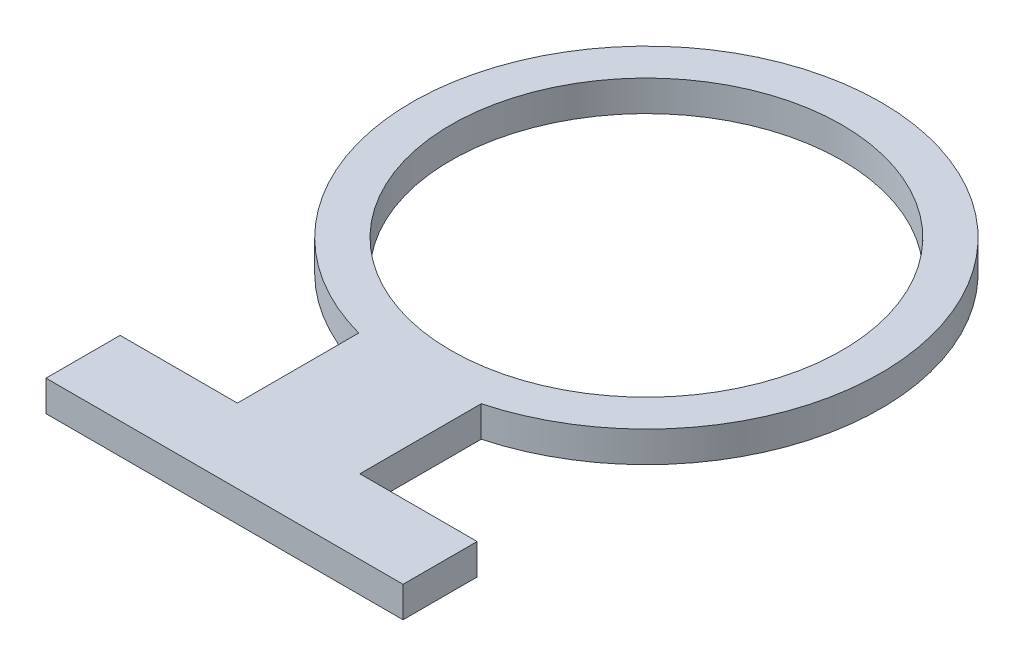
ISO-10303-21;
HEADER;
FILE_DESCRIPTION(('STEP AP214'),'2;1');
FILE_NAME('part.step','',(''),(''),'','','');
FILE_SCHEMA(('AUTOMOTIVE_DESIGN { 1 0 10303 214 1 1 1 1 }'));
ENDSEC;
DATA;
#1=APPLICATION_CONTEXT('core data for automotive mechanical design processes');
#2=APPLICATION_PROTOCOL_DEFINITION('international standard','automotive_design',2000,#1);
#3=PRODUCT_CONTEXT('',#1,'mechanical');
#4=PRODUCT('Part','Part','',(#3));
#5=PRODUCT_RELATED_PRODUCT_CATEGORY('part','',(#4));
#6=PRODUCT_DEFINITION_FORMATION('','',#4);
#7=PRODUCT_DEFINITION_CONTEXT('part definition',#1,'design');
#8=PRODUCT_DEFINITION('design','',#6,#7);
#9=PRODUCT_DEFINITION_SHAPE('','',#8);
#10=(LENGTH_UNIT() NAMED_UNIT(*) SI_UNIT(.MILLI.,.METRE.));
#11=(NAMED_UNIT(*) PLANE_ANGLE_UNIT() SI_UNIT($,.RADIAN.));
#12=(NAMED_UNIT(*) SI_UNIT($,.STERADIAN.) SOLID_ANGLE_UNIT());
#13=UNCERTAINTY_MEASURE_WITH_UNIT(LENGTH_MEASURE(1.E-05),#10,'distance_accuracy_value','');
#14=(GEOMETRIC_REPRESENTATION_CONTEXT(3) GLOBAL_UNCERTAINTY_ASSIGNED_CONTEXT((#13)) GLOBAL_UNIT_ASSIGNED_CONTEXT((#10,
#11,#12)) REPRESENTATION_CONTEXT('',''));
#15=CARTESIAN_POINT('',(0.,0.,0.));
#16=DIRECTION('',(0.,0.,1.));
#17=DIRECTION('',(1.,0.,0.));
#18=AXIS2_PLACEMENT_3D('',#15,#16,#17);
#19=CARTESIAN_POINT('',(0.,10.,0.));
#20=DIRECTION('',(0.,-1.,0.));
#21=DIRECTION('',(0.,0.,-1.));
#22=AXIS2_PLACEMENT_3D('',#19,#20,#21);
#23=CYLINDRICAL_SURFACE('',#22,63.5);
#24=CARTESIAN_POINT('',(0.,10.,0.));
#25=DIRECTION('',(0.,1.,0.));
#26=DIRECTION('',(0.,0.,1.));
#27=AXIS2_PLACEMENT_3D('',#24,#25,#26);
#28=CIRCLE('',#27,63.5);
#29=CARTESIAN_POINT('',(0.,10.,63.5));
#30=VERTEX_POINT('',#29);
#31=EDGE_CURVE('E189',#30,#30,#28,.T.);
#32=ORIENTED_EDGE('',*,*,#31,.T.);
#33=EDGE_LOOP('',(#32));
#34=FACE_BOUND('',#33,.T.);
#35=CARTESIAN_POINT('',(0.,0.,0.));
#36=DIRECTION('',(0.,1.,0.));
#37=DIRECTION('',(0.,0.,1.));
#38=AXIS2_PLACEMENT_3D('',#35,#36,#37);
#39=CIRCLE('',#38,63.5);
#40=CARTESIAN_POINT('',(0.,0.,63.5));
#41=VERTEX_POINT('',#40);
#42=EDGE_CURVE('E181',#41,#41,#39,.T.);
#43=ORIENTED_EDGE('',*,*,#42,.F.);
#44=EDGE_LOOP('',(#43));
#45=FACE_BOUND('',#44,.T.);
#46=ADVANCED_FACE('F80',(#34,#45),#23,.F.);
#47=CARTESIAN_POINT('',(0.,10.,0.));
#48=DIRECTION('',(0.,-1.,0.));
#49=DIRECTION('',(0.,0.,-1.));
#50=AXIS2_PLACEMENT_3D('',#47,#48,#49);
#51=CYLINDRICAL_SURFACE('',#50,76.2);
#52=CARTESIAN_POINT('',(0.,0.,0.));
#53=DIRECTION('',(0.,1.,0.));
#54=DIRECTION('',(0.,0.,1.));
#55=AXIS2_PLACEMENT_3D('',#52,#53,#54);
#56=CIRCLE('',#55,76.2);
#57=CARTESIAN_POINT('',(19.8954600099373,0.,73.5568533244387));
#58=VERTEX_POINT('',#57);
#59=CARTESIAN_POINT('',(-19.8954600099373,0.,73.5568533244387));
#60=VERTEX_POINT('',#59);
#61=EDGE_CURVE('E165',#58,#60,#56,.T.);
#62=ORIENTED_EDGE('',*,*,#61,.T.);
#63=DIRECTION('',(0.,-1.,0.));
#64=VECTOR('',#63,1.);
#65=CARTESIAN_POINT('',(-19.8954600099373,10.,73.5568533244387));
#66=LINE('',#65,#64);
#67=CARTESIAN_POINT('',(-19.8954600099373,10.,73.5568533244387));
#68=VERTEX_POINT('',#67);
#69=EDGE_CURVE('E90',#68,#60,#66,.T.);
#70=ORIENTED_EDGE('',*,*,#69,.F.);
#71=CARTESIAN_POINT('',(0.,10.,0.));
#72=DIRECTION('',(0.,1.,0.));
#73=DIRECTION('',(0.,0.,1.));
#74=AXIS2_PLACEMENT_3D('',#71,#72,#73);
#75=CIRCLE('',#74,76.2);
#76=CARTESIAN_POINT('',(19.8954600099373,10.,73.5568533244387));
#77=VERTEX_POINT('',#76);
#78=EDGE_CURVE('E192',#77,#68,#75,.T.);
#79=ORIENTED_EDGE('',*,*,#78,.F.);
#80=DIRECTION('',(0.,-1.,0.));
#81=VECTOR('',#80,1.);
#82=CARTESIAN_POINT('',(19.8954600099373,10.,73.5568533244387));
#83=LINE('',#82,#81);
#84=EDGE_CURVE('E12',#77,#58,#83,.T.);
#85=ORIENTED_EDGE('',*,*,#84,.T.);
#86=EDGE_LOOP('',(#62,#70,#79,#85));
#87=FACE_BOUND('',#86,.T.);
#88=ADVANCED_FACE('F241',(#87),#51,.T.);
#89=CARTESIAN_POINT('',(0.,10.,0.));
#90=DIRECTION('',(0.,1.,0.));
#91=DIRECTION('',(0.,0.,1.));
#92=AXIS2_PLACEMENT_3D('',#89,#90,#91);
#93=PLANE('',#92);
#94=ORIENTED_EDGE('',*,*,#31,.F.);
#95=EDGE_LOOP('',(#94));
#96=FACE_BOUND('',#95,.T.);
#97=ORIENTED_EDGE('',*,*,#78,.T.);
#98=DIRECTION('',(0.,0.,-1.));
#99=VECTOR('',#98,1.);
#100=CARTESIAN_POINT('',(-19.8954600099373,10.,0.));
#101=LINE('',#100,#99);
#102=CARTESIAN_POINT('',(-19.8954600099373,10.,112.983657033877));
#103=VERTEX_POINT('',#102);
#104=EDGE_CURVE('E166',#103,#68,#101,.T.);
#105=ORIENTED_EDGE('',*,*,#104,.F.);
#106=DIRECTION('',(1.,0.,0.));
#107=VECTOR('',#106,1.);
#108=CARTESIAN_POINT('',(0.,10.,112.983657033877));
#109=LINE('',#108,#107);
#110=CARTESIAN_POINT('',(-57.9954600099373,10.,112.983657033877));
#111=VERTEX_POINT('',#110);
#112=EDGE_CURVE('E168',#111,#103,#109,.T.);
#113=ORIENTED_EDGE('',*,*,#112,.F.);
#114=DIRECTION('',(0.,0.,-1.));
#115=VECTOR('',#114,1.);
#116=CARTESIAN_POINT('',(-57.9954600099373,10.,0.));
#117=LINE('',#116,#115);
#118=CARTESIAN_POINT('',(-57.9954600099373,10.,137.056853324439));
#119=VERTEX_POINT('',#118);
#120=EDGE_CURVE('E197',#119,#111,#117,.T.);
#121=ORIENTED_EDGE('',*,*,#120,.F.);
#122=DIRECTION('',(-1.,0.,0.));
#123=VECTOR('',#122,1.);
#124=CARTESIAN_POINT('',(0.,10.,137.056853324439));
#125=LINE('',#124,#123);
#126=CARTESIAN_POINT('',(57.9954600099373,10.,137.056853324439));
#127=VERTEX_POINT('',#126);
#128=EDGE_CURVE('E199',#127,#119,#125,.T.);
#129=ORIENTED_EDGE('',*,*,#128,.F.);
#130=DIRECTION('',(0.,0.,1.));
#131=VECTOR('',#130,1.);
#132=CARTESIAN_POINT('',(57.9954600099374,10.,0.));
#133=LINE('',#132,#131);
#134=CARTESIAN_POINT('',(57.9954600099373,10.,112.983657033877));
#135=VERTEX_POINT('',#134);
#136=EDGE_CURVE('E202',#135,#127,#133,.T.);
#137=ORIENTED_EDGE('',*,*,#136,.F.);
#138=DIRECTION('',(1.,0.,0.));
#139=VECTOR('',#138,1.);
#140=CARTESIAN_POINT('',(0.,10.,112.983657033877));
#141=LINE('',#140,#139);
#142=CARTESIAN_POINT('',(19.8954600099373,10.,112.983657033877));
#143=VERTEX_POINT('',#142);
#144=EDGE_CURVE('E205',#143,#135,#141,.T.);
#145=ORIENTED_EDGE('',*,*,#144,.F.);
#146=DIRECTION('',(0.,0.,1.));
#147=VECTOR('',#146,1.);
#148=CARTESIAN_POINT('',(19.8954600099373,10.,0.));
#149=LINE('',#148,#147);
#150=EDGE_CURVE('E153',#77,#143,#149,.T.);
#151=ORIENTED_EDGE('',*,*,#150,.F.);
#152=EDGE_LOOP('',(#97,#105,#113,#121,#129,#137,#145,#151));
#153=FACE_BOUND('',#152,.T.);
#154=ADVANCED_FACE('F232',(#96,#153),#93,.T.);
#155=CARTESIAN_POINT('',(0.,0.,0.));
#156=DIRECTION('',(0.,1.,0.));
#157=DIRECTION('',(0.,0.,1.));
#158=AXIS2_PLACEMENT_3D('',#155,#156,#157);
#159=PLANE('',#158);
#160=ORIENTED_EDGE('',*,*,#42,.T.);
#161=EDGE_LOOP('',(#160));
#162=FACE_BOUND('',#161,.T.);
#163=ORIENTED_EDGE('',*,*,#61,.F.);
#164=DIRECTION('',(0.,0.,1.));
#165=VECTOR('',#164,1.);
#166=CARTESIAN_POINT('',(19.8954600099373,0.,0.));
#167=LINE('',#166,#165);
#168=CARTESIAN_POINT('',(19.8954600099373,0.,112.983657033877));
#169=VERTEX_POINT('',#168);
#170=EDGE_CURVE('E150',#58,#169,#167,.T.);
#171=ORIENTED_EDGE('',*,*,#170,.T.);
#172=DIRECTION('',(1.,0.,0.));
#173=VECTOR('',#172,1.);
#174=CARTESIAN_POINT('',(0.,0.,112.983657033877));
#175=LINE('',#174,#173);
#176=CARTESIAN_POINT('',(57.9954600099373,0.,112.983657033877));
#177=VERTEX_POINT('',#176);
#178=EDGE_CURVE('E157',#169,#177,#175,.T.);
#179=ORIENTED_EDGE('',*,*,#178,.T.);
#180=DIRECTION('',(0.,0.,1.));
#181=VECTOR('',#180,1.);
#182=CARTESIAN_POINT('',(57.9954600099374,0.,0.));
#183=LINE('',#182,#181);
#184=CARTESIAN_POINT('',(57.9954600099373,0.,137.056853324439));
#185=VERTEX_POINT('',#184);
#186=EDGE_CURVE('E161',#177,#185,#183,.T.);
#187=ORIENTED_EDGE('',*,*,#186,.T.);
#188=DIRECTION('',(-1.,0.,0.));
#189=VECTOR('',#188,1.);
#190=CARTESIAN_POINT('',(0.,0.,137.056853324439));
#191=LINE('',#190,#189);
#192=CARTESIAN_POINT('',(-57.9954600099373,0.,137.056853324439));
#193=VERTEX_POINT('',#192);
#194=EDGE_CURVE('E216',#185,#193,#191,.T.);
#195=ORIENTED_EDGE('',*,*,#194,.T.);
#196=DIRECTION('',(0.,0.,-1.));
#197=VECTOR('',#196,1.);
#198=CARTESIAN_POINT('',(-57.9954600099373,0.,0.));
#199=LINE('',#198,#197);
#200=CARTESIAN_POINT('',(-57.9954600099373,0.,112.983657033877));
#201=VERTEX_POINT('',#200);
#202=EDGE_CURVE('E213',#193,#201,#199,.T.);
#203=ORIENTED_EDGE('',*,*,#202,.T.);
#204=DIRECTION('',(1.,0.,0.));
#205=VECTOR('',#204,1.);
#206=CARTESIAN_POINT('',(0.,0.,112.983657033877));
#207=LINE('',#206,#205);
#208=CARTESIAN_POINT('',(-19.8954600099373,0.,112.983657033877));
#209=VERTEX_POINT('',#208);
#210=EDGE_CURVE('E210',#201,#209,#207,.T.);
#211=ORIENTED_EDGE('',*,*,#210,.T.);
#212=DIRECTION('',(0.,0.,-1.));
#213=VECTOR('',#212,1.);
#214=CARTESIAN_POINT('',(-19.8954600099373,0.,0.));
#215=LINE('',#214,#213);
#216=EDGE_CURVE('E208',#209,#60,#215,.T.);
#217=ORIENTED_EDGE('',*,*,#216,.T.);
#218=EDGE_LOOP('',(#163,#171,#179,#187,#195,#203,#211,#217));
#219=FACE_BOUND('',#218,.T.);
#220=ADVANCED_FACE('F163',(#162,#219),#159,.F.);
#221=CARTESIAN_POINT('',(-57.9954600099373,10.,0.));
#222=DIRECTION('',(-1.,0.,0.));
#223=DIRECTION('',(0.,0.,1.));
#224=AXIS2_PLACEMENT_3D('',#221,#222,#223);
#225=PLANE('',#224);
#226=ORIENTED_EDGE('',*,*,#202,.F.);
#227=DIRECTION('',(0.,-1.,0.));
#228=VECTOR('',#227,1.);
#229=CARTESIAN_POINT('',(-57.9954600099373,10.,137.056853324439));
#230=LINE('',#229,#228);
#231=EDGE_CURVE('E175',#119,#193,#230,.T.);
#232=ORIENTED_EDGE('',*,*,#231,.F.);
#233=ORIENTED_EDGE('',*,*,#120,.T.);
#234=DIRECTION('',(0.,-1.,0.));
#235=VECTOR('',#234,1.);
#236=CARTESIAN_POINT('',(-57.9954600099373,10.,112.983657033877));
#237=LINE('',#236,#235);
#238=EDGE_CURVE('E176',#111,#201,#237,.T.);
#239=ORIENTED_EDGE('',*,*,#238,.T.);
#240=EDGE_LOOP('',(#226,#232,#233,#239));
#241=FACE_BOUND('',#240,.T.);
#242=ADVANCED_FACE('F226',(#241),#225,.T.);
#243=CARTESIAN_POINT('',(0.,10.,137.056853324439));
#244=DIRECTION('',(0.,0.,1.));
#245=DIRECTION('',(1.,0.,0.));
#246=AXIS2_PLACEMENT_3D('',#243,#244,#245);
#247=PLANE('',#246);
#248=ORIENTED_EDGE('',*,*,#194,.F.);
#249=DIRECTION('',(0.,-1.,0.));
#250=VECTOR('',#249,1.);
#251=CARTESIAN_POINT('',(57.9954600099373,10.,137.056853324439));
#252=LINE('',#251,#250);
#253=EDGE_CURVE('E173',#127,#185,#252,.T.);
#254=ORIENTED_EDGE('',*,*,#253,.F.);
#255=ORIENTED_EDGE('',*,*,#128,.T.);
#256=ORIENTED_EDGE('',*,*,#231,.T.);
#257=EDGE_LOOP('',(#248,#254,#255,#256));
#258=FACE_BOUND('',#257,.T.);
#259=ADVANCED_FACE('F224',(#258),#247,.T.);
#260=CARTESIAN_POINT('',(57.9954600099374,10.,0.));
#261=DIRECTION('',(1.,0.,0.));
#262=DIRECTION('',(0.,0.,-1.));
#263=AXIS2_PLACEMENT_3D('',#260,#261,#262);
#264=PLANE('',#263);
#265=ORIENTED_EDGE('',*,*,#186,.F.);
#266=DIRECTION('',(0.,-1.,0.));
#267=VECTOR('',#266,1.);
#268=CARTESIAN_POINT('',(57.9954600099373,10.,112.983657033877));
#269=LINE('',#268,#267);
#270=EDGE_CURVE('E141',#135,#177,#269,.T.);
#271=ORIENTED_EDGE('',*,*,#270,.F.);
#272=ORIENTED_EDGE('',*,*,#136,.T.);
#273=ORIENTED_EDGE('',*,*,#253,.T.);
#274=EDGE_LOOP('',(#265,#271,#272,#273));
#275=FACE_BOUND('',#274,.T.);
#276=ADVANCED_FACE('F220',(#275),#264,.T.);
#277=CARTESIAN_POINT('',(0.,10.,112.983657033877));
#278=DIRECTION('',(0.,0.,-1.));
#279=DIRECTION('',(-1.,0.,0.));
#280=AXIS2_PLACEMENT_3D('',#277,#278,#279);
#281=PLANE('',#280);
#282=ORIENTED_EDGE('',*,*,#178,.F.);
#283=DIRECTION('',(0.,-1.,0.));
#284=VECTOR('',#283,1.);
#285=CARTESIAN_POINT('',(19.8954600099373,10.,112.983657033877));
#286=LINE('',#285,#284);
#287=EDGE_CURVE('E147',#143,#169,#286,.T.);
#288=ORIENTED_EDGE('',*,*,#287,.F.);
#289=ORIENTED_EDGE('',*,*,#144,.T.);
#290=ORIENTED_EDGE('',*,*,#270,.T.);
#291=EDGE_LOOP('',(#282,#288,#289,#290));
#292=FACE_BOUND('',#291,.T.);
#293=ADVANCED_FACE('F158',(#292),#281,.T.);
#294=CARTESIAN_POINT('',(0.,10.,112.983657033877));
#295=DIRECTION('',(0.,0.,-1.));
#296=DIRECTION('',(-1.,0.,0.));
#297=AXIS2_PLACEMENT_3D('',#294,#295,#296);
#298=PLANE('',#297);
#299=ORIENTED_EDGE('',*,*,#210,.F.);
#300=ORIENTED_EDGE('',*,*,#238,.F.);
#301=ORIENTED_EDGE('',*,*,#112,.T.);
#302=DIRECTION('',(0.,-1.,0.));
#303=VECTOR('',#302,1.);
#304=CARTESIAN_POINT('',(-19.8954600099373,10.,112.983657033877));
#305=LINE('',#304,#303);
#306=EDGE_CURVE('E84',#103,#209,#305,.T.);
#307=ORIENTED_EDGE('',*,*,#306,.T.);
#308=EDGE_LOOP('',(#299,#300,#301,#307));
#309=FACE_BOUND('',#308,.T.);
#310=ADVANCED_FACE('F227',(#309),#298,.T.);
#311=CARTESIAN_POINT('',(-19.8954600099373,10.,0.));
#312=DIRECTION('',(-1.,0.,0.));
#313=DIRECTION('',(0.,0.,1.));
#314=AXIS2_PLACEMENT_3D('',#311,#312,#313);
#315=PLANE('',#314);
#316=ORIENTED_EDGE('',*,*,#216,.F.);
#317=ORIENTED_EDGE('',*,*,#306,.F.);
#318=ORIENTED_EDGE('',*,*,#104,.T.);
#319=ORIENTED_EDGE('',*,*,#69,.T.);
#320=EDGE_LOOP('',(#316,#317,#318,#319));
#321=FACE_BOUND('',#320,.T.);
#322=ADVANCED_FACE('F82',(#321),#315,.T.);
#323=CARTESIAN_POINT('',(19.8954600099373,10.,0.));
#324=DIRECTION('',(1.,0.,0.));
#325=DIRECTION('',(0.,0.,-1.));
#326=AXIS2_PLACEMENT_3D('',#323,#324,#325);
#327=PLANE('',#326);
#328=ORIENTED_EDGE('',*,*,#170,.F.);
#329=ORIENTED_EDGE('',*,*,#84,.F.);
#330=ORIENTED_EDGE('',*,*,#150,.T.);
#331=ORIENTED_EDGE('',*,*,#287,.T.);
#332=EDGE_LOOP('',(#328,#329,#330,#331));
#333=FACE_BOUND('',#332,.T.);
#334=ADVANCED_FACE('F148',(#333),#327,.T.);
#335=CLOSED_SHELL('',(#46,#88,#154,#220,#242,#259,#276,#293,#310,#322,#334));
#336=MANIFOLD_SOLID_BREP('B2',#335);
#337=ADVANCED_BREP_SHAPE_REPRESENTATION('',(#18,#336),#14);
#338=SHAPE_DEFINITION_REPRESENTATION(#9,#337);
ENDSEC;
END-ISO-10303-21;
